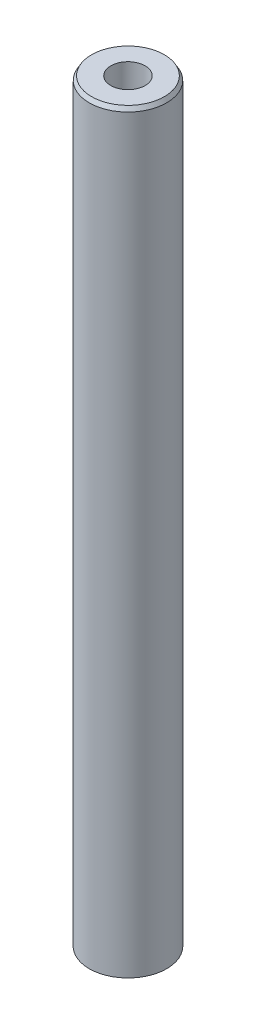
ISO-10303-21;
HEADER;
FILE_DESCRIPTION(('STEP AP214'),'2;1');
FILE_NAME('part.step','',(''),(''),'','','');
FILE_SCHEMA(('AUTOMOTIVE_DESIGN { 1 0 10303 214 1 1 1 1 }'));
ENDSEC;
DATA;
#1=APPLICATION_CONTEXT('core data for automotive mechanical design processes');
#2=APPLICATION_PROTOCOL_DEFINITION('international standard','automotive_design',2000,#1);
#3=PRODUCT_CONTEXT('',#1,'mechanical');
#4=PRODUCT('Part','Part','',(#3));
#5=PRODUCT_RELATED_PRODUCT_CATEGORY('part','',(#4));
#6=PRODUCT_DEFINITION_FORMATION('','',#4);
#7=PRODUCT_DEFINITION_CONTEXT('part definition',#1,'design');
#8=PRODUCT_DEFINITION('design','',#6,#7);
#9=PRODUCT_DEFINITION_SHAPE('','',#8);
#10=(LENGTH_UNIT() NAMED_UNIT(*) SI_UNIT(.MILLI.,.METRE.));
#11=(NAMED_UNIT(*) PLANE_ANGLE_UNIT() SI_UNIT($,.RADIAN.));
#12=(NAMED_UNIT(*) SI_UNIT($,.STERADIAN.) SOLID_ANGLE_UNIT());
#13=UNCERTAINTY_MEASURE_WITH_UNIT(LENGTH_MEASURE(1.E-05),#10,'distance_accuracy_value','');
#14=(GEOMETRIC_REPRESENTATION_CONTEXT(3) GLOBAL_UNCERTAINTY_ASSIGNED_CONTEXT((#13)) GLOBAL_UNIT_ASSIGNED_CONTEXT((#10,
#11,#12)) REPRESENTATION_CONTEXT('',''));
#15=CARTESIAN_POINT('',(0.,0.,0.));
#16=DIRECTION('',(0.,0.,1.));
#17=DIRECTION('',(1.,0.,0.));
#18=AXIS2_PLACEMENT_3D('',#15,#16,#17);
#19=CARTESIAN_POINT('',(0.,585.730108051593,0.));
#20=DIRECTION('',(0.,-1.,0.));
#21=DIRECTION('',(0.,0.,-1.));
#22=AXIS2_PLACEMENT_3D('',#19,#20,#21);
#23=CYLINDRICAL_SURFACE('',#22,30.);
#24=CARTESIAN_POINT('',(0.,582.527560631022,0.));
#25=DIRECTION('',(0.,1.,0.));
#26=DIRECTION('',(0.,0.,1.));
#27=AXIS2_PLACEMENT_3D('',#24,#25,#26);
#28=CIRCLE('',#27,30.);
#29=CARTESIAN_POINT('',(0.,582.527560631022,30.));
#30=VERTEX_POINT('',#29);
#31=EDGE_CURVE('E50',#30,#30,#28,.F.);
#32=ORIENTED_EDGE('',*,*,#31,.T.);
#33=EDGE_LOOP('',(#32));
#34=FACE_BOUND('',#33,.T.);
#35=CARTESIAN_POINT('',(0.,1.84899161535934,0.));
#36=DIRECTION('',(0.,1.,0.));
#37=DIRECTION('',(0.,0.,1.));
#38=AXIS2_PLACEMENT_3D('',#35,#36,#37);
#39=CIRCLE('',#38,30.);
#40=CARTESIAN_POINT('',(0.,1.84899161535934,30.));
#41=VERTEX_POINT('',#40);
#42=EDGE_CURVE('E51',#41,#41,#39,.T.);
#43=ORIENTED_EDGE('',*,*,#42,.T.);
#44=EDGE_LOOP('',(#43));
#45=FACE_BOUND('',#44,.T.);
#46=ADVANCED_FACE('F39',(#34,#45),#23,.T.);
#47=CARTESIAN_POINT('',(0.,585.730108051593,0.));
#48=DIRECTION('',(0.,1.,0.));
#49=DIRECTION('',(0.,0.,1.));
#50=AXIS2_PLACEMENT_3D('',#47,#48,#49);
#51=PLANE('',#50);
#52=CARTESIAN_POINT('',(0.,585.730108051593,0.));
#53=DIRECTION('',(0.,1.,0.));
#54=DIRECTION('',(0.,0.,1.));
#55=AXIS2_PLACEMENT_3D('',#52,#53,#54);
#56=CIRCLE('',#55,28.1510083846407);
#57=CARTESIAN_POINT('',(0.,585.730108051593,28.1510083846407));
#58=VERTEX_POINT('',#57);
#59=EDGE_CURVE('E54',#58,#58,#56,.T.);
#60=ORIENTED_EDGE('',*,*,#59,.T.);
#61=EDGE_LOOP('',(#60));
#62=FACE_BOUND('',#61,.T.);
#63=CARTESIAN_POINT('',(0.,585.730108051593,0.));
#64=DIRECTION('',(0.,1.,0.));
#65=DIRECTION('',(0.,0.,1.));
#66=AXIS2_PLACEMENT_3D('',#63,#64,#65);
#67=CIRCLE('',#66,13.2898742720212);
#68=CARTESIAN_POINT('',(0.,585.730108051593,13.2898742720212));
#69=VERTEX_POINT('',#68);
#70=EDGE_CURVE('E58',#69,#69,#67,.T.);
#71=ORIENTED_EDGE('',*,*,#70,.F.);
#72=EDGE_LOOP('',(#71));
#73=FACE_BOUND('',#72,.T.);
#74=ADVANCED_FACE('F69',(#62,#73),#51,.T.);
#75=CARTESIAN_POINT('',(0.,0.,0.));
#76=DIRECTION('',(0.,1.,0.));
#77=DIRECTION('',(0.,0.,1.));
#78=AXIS2_PLACEMENT_3D('',#75,#76,#77);
#79=PLANE('',#78);
#80=CARTESIAN_POINT('',(0.,0.,0.));
#81=DIRECTION('',(0.,1.,0.));
#82=DIRECTION('',(0.,0.,1.));
#83=AXIS2_PLACEMENT_3D('',#80,#81,#82);
#84=CIRCLE('',#83,26.7974525794287);
#85=CARTESIAN_POINT('',(0.,0.,26.7974525794287));
#86=VERTEX_POINT('',#85);
#87=EDGE_CURVE('E10',#86,#86,#84,.F.);
#88=ORIENTED_EDGE('',*,*,#87,.T.);
#89=EDGE_LOOP('',(#88));
#90=FACE_BOUND('',#89,.T.);
#91=CARTESIAN_POINT('',(0.,0.,0.));
#92=DIRECTION('',(0.,1.,0.));
#93=DIRECTION('',(0.,0.,1.));
#94=AXIS2_PLACEMENT_3D('',#91,#92,#93);
#95=CIRCLE('',#94,13.2898742720212);
#96=CARTESIAN_POINT('',(0.,0.,13.2898742720212));
#97=VERTEX_POINT('',#96);
#98=EDGE_CURVE('E63',#97,#97,#95,.T.);
#99=ORIENTED_EDGE('',*,*,#98,.T.);
#100=EDGE_LOOP('',(#99));
#101=FACE_BOUND('',#100,.T.);
#102=ADVANCED_FACE('F75',(#90,#101),#79,.F.);
#103=CARTESIAN_POINT('',(0.,585.730108051593,0.));
#104=DIRECTION('',(0.,-1.,0.));
#105=DIRECTION('',(0.,0.,-1.));
#106=AXIS2_PLACEMENT_3D('',#103,#104,#105);
#107=CYLINDRICAL_SURFACE('',#106,13.2898742720212);
#108=ORIENTED_EDGE('',*,*,#70,.T.);
#109=EDGE_LOOP('',(#108));
#110=FACE_BOUND('',#109,.T.);
#111=ORIENTED_EDGE('',*,*,#98,.F.);
#112=EDGE_LOOP('',(#111));
#113=FACE_BOUND('',#112,.T.);
#114=ADVANCED_FACE('F70',(#110,#113),#107,.F.);
#115=CARTESIAN_POINT('',(0.,585.730108051593,0.));
#116=DIRECTION('',(0.,-1.,0.));
#117=DIRECTION('',(0.,0.,-1.));
#118=AXIS2_PLACEMENT_3D('',#115,#116,#117);
#119=CONICAL_SURFACE('',#118,28.1510083846407,0.523598775598305);
#120=ORIENTED_EDGE('',*,*,#31,.F.);
#121=EDGE_LOOP('',(#120));
#122=FACE_BOUND('',#121,.T.);
#123=ORIENTED_EDGE('',*,*,#59,.F.);
#124=EDGE_LOOP('',(#123));
#125=FACE_BOUND('',#124,.T.);
#126=ADVANCED_FACE('F81',(#122,#125),#119,.T.);
#127=CARTESIAN_POINT('',(0.,1.84899161535934,0.));
#128=DIRECTION('',(0.,1.,0.));
#129=DIRECTION('',(0.,0.,1.));
#130=AXIS2_PLACEMENT_3D('',#127,#128,#129);
#131=CONICAL_SURFACE('',#130,30.,1.04719755119661);
#132=ORIENTED_EDGE('',*,*,#87,.F.);
#133=EDGE_LOOP('',(#132));
#134=FACE_BOUND('',#133,.T.);
#135=ORIENTED_EDGE('',*,*,#42,.F.);
#136=EDGE_LOOP('',(#135));
#137=FACE_BOUND('',#136,.T.);
#138=ADVANCED_FACE('F45',(#134,#137),#131,.T.);
#139=CLOSED_SHELL('',(#46,#74,#102,#114,#126,#138));
#140=MANIFOLD_SOLID_BREP('B2',#139);
#141=ADVANCED_BREP_SHAPE_REPRESENTATION('',(#18,#140),#14);
#142=SHAPE_DEFINITION_REPRESENTATION(#9,#141);
ENDSEC;
END-ISO-10303-21;
